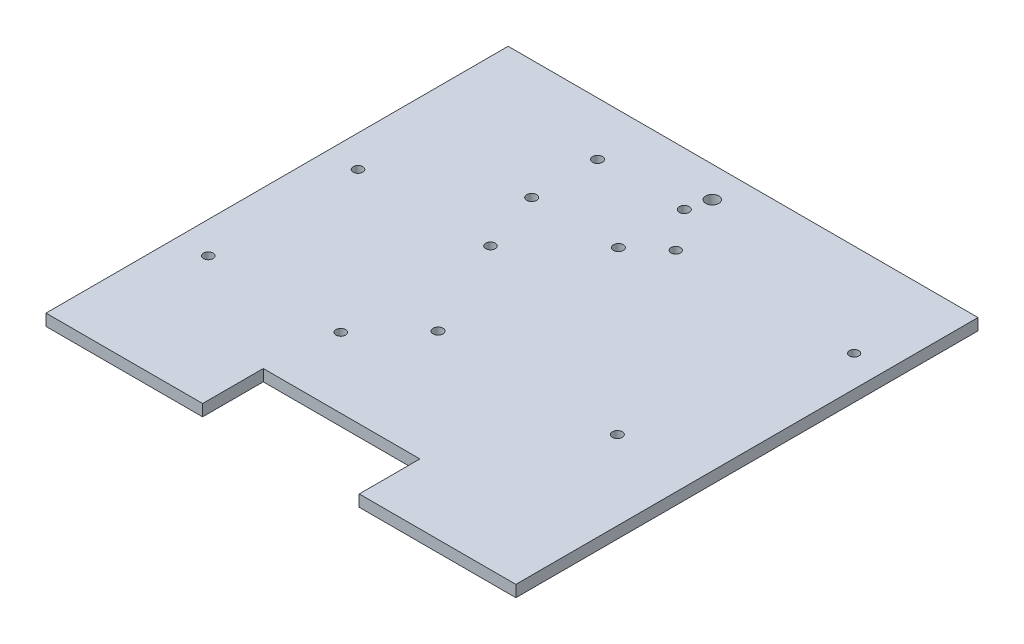
ISO-10303-21;
HEADER;
FILE_DESCRIPTION(('STEP AP214'),'2;1');
FILE_NAME('part.step','',(''),(''),'','','');
FILE_SCHEMA(('AUTOMOTIVE_DESIGN { 1 0 10303 214 1 1 1 1 }'));
ENDSEC;
DATA;
#1=APPLICATION_CONTEXT('core data for automotive mechanical design processes');
#2=APPLICATION_PROTOCOL_DEFINITION('international standard','automotive_design',2000,#1);
#3=PRODUCT_CONTEXT('',#1,'mechanical');
#4=PRODUCT('Part','Part','',(#3));
#5=PRODUCT_RELATED_PRODUCT_CATEGORY('part','',(#4));
#6=PRODUCT_DEFINITION_FORMATION('','',#4);
#7=PRODUCT_DEFINITION_CONTEXT('part definition',#1,'design');
#8=PRODUCT_DEFINITION('design','',#6,#7);
#9=PRODUCT_DEFINITION_SHAPE('','',#8);
#10=(LENGTH_UNIT() NAMED_UNIT(*) SI_UNIT(.MILLI.,.METRE.));
#11=(NAMED_UNIT(*) PLANE_ANGLE_UNIT() SI_UNIT($,.RADIAN.));
#12=(NAMED_UNIT(*) SI_UNIT($,.STERADIAN.) SOLID_ANGLE_UNIT());
#13=UNCERTAINTY_MEASURE_WITH_UNIT(LENGTH_MEASURE(1.E-05),#10,'distance_accuracy_value','');
#14=(GEOMETRIC_REPRESENTATION_CONTEXT(3) GLOBAL_UNCERTAINTY_ASSIGNED_CONTEXT((#13)) GLOBAL_UNIT_ASSIGNED_CONTEXT((#10,
#11,#12)) REPRESENTATION_CONTEXT('',''));
#15=CARTESIAN_POINT('',(0.,0.,0.));
#16=DIRECTION('',(0.,0.,1.));
#17=DIRECTION('',(1.,0.,0.));
#18=AXIS2_PLACEMENT_3D('',#15,#16,#17);
#19=CARTESIAN_POINT('',(0.,4.78,0.));
#20=DIRECTION('',(0.,-1.,0.));
#21=DIRECTION('',(0.,0.,-1.));
#22=AXIS2_PLACEMENT_3D('',#19,#20,#21);
#23=PLANE('',#22);
#24=CARTESIAN_POINT('',(-38.0049999999998,4.78,-73.2749999992753));
#25=DIRECTION('',(0.,1.,0.));
#26=DIRECTION('',(0.,0.,1.));
#27=AXIS2_PLACEMENT_3D('',#24,#25,#26);
#28=CIRCLE('',#27,2.048699992);
#29=CARTESIAN_POINT('',(-38.0049999999998,4.78,-71.2263000072753));
#30=VERTEX_POINT('',#29);
#31=EDGE_CURVE('E208',#30,#30,#28,.T.);
#32=ORIENTED_EDGE('',*,*,#31,.F.);
#33=EDGE_LOOP('',(#32));
#34=FACE_BOUND('',#33,.T.);
#35=CARTESIAN_POINT('',(-83.822499998781,4.78,-20.3400000010795));
#36=DIRECTION('',(0.,1.,0.));
#37=DIRECTION('',(0.,0.,1.));
#38=AXIS2_PLACEMENT_3D('',#35,#36,#37);
#39=CIRCLE('',#38,1.9812);
#40=CARTESIAN_POINT('',(-83.822499998781,4.78,-18.3588000010795));
#41=VERTEX_POINT('',#40);
#42=EDGE_CURVE('E231',#41,#41,#39,.T.);
#43=ORIENTED_EDGE('',*,*,#42,.F.);
#44=EDGE_LOOP('',(#43));
#45=FACE_BOUND('',#44,.T.);
#46=CARTESIAN_POINT('',(-9.61000000000007,4.78,20.864999962));
#47=DIRECTION('',(0.,1.,0.));
#48=DIRECTION('',(0.,0.,1.));
#49=AXIS2_PLACEMENT_3D('',#46,#47,#48);
#50=CIRCLE('',#49,2.038700012);
#51=CARTESIAN_POINT('',(-9.61000000000007,4.78,22.903699974));
#52=VERTEX_POINT('',#51);
#53=EDGE_CURVE('E189',#52,#52,#50,.T.);
#54=ORIENTED_EDGE('',*,*,#53,.F.);
#55=EDGE_LOOP('',(#54));
#56=FACE_BOUND('',#55,.T.);
#57=CARTESIAN_POINT('',(84.0775,4.78,-56.9625000000001));
#58=DIRECTION('',(0.,1.,0.));
#59=DIRECTION('',(0.,0.,1.));
#60=AXIS2_PLACEMENT_3D('',#57,#58,#59);
#61=CIRCLE('',#60,1.93619996299999);
#62=CARTESIAN_POINT('',(84.0775,4.78,-55.0263000370001));
#63=VERTEX_POINT('',#62);
#64=EDGE_CURVE('E195',#63,#63,#61,.T.);
#65=ORIENTED_EDGE('',*,*,#64,.F.);
#66=EDGE_LOOP('',(#65));
#67=FACE_BOUND('',#66,.T.);
#68=CARTESIAN_POINT('',(10.5225,4.78,-56.9625000620011));
#69=DIRECTION('',(0.,1.,0.));
#70=DIRECTION('',(0.,0.,1.));
#71=AXIS2_PLACEMENT_3D('',#68,#69,#70);
#72=CIRCLE('',#71,1.936199963);
#73=CARTESIAN_POINT('',(10.5225,4.78,-55.0263000990011));
#74=VERTEX_POINT('',#73);
#75=EDGE_CURVE('E196',#74,#74,#72,.T.);
#76=ORIENTED_EDGE('',*,*,#75,.F.);
#77=EDGE_LOOP('',(#76));
#78=FACE_BOUND('',#77,.T.);
#79=CARTESIAN_POINT('',(-2.25499999999983,4.78,-73.275));
#80=DIRECTION('',(0.,1.,0.));
#81=DIRECTION('',(0.,0.,1.));
#82=AXIS2_PLACEMENT_3D('',#79,#80,#81);
#83=CIRCLE('',#82,2.048699992);
#84=CARTESIAN_POINT('',(-2.25499999999983,4.78,-71.226300008));
#85=VERTEX_POINT('',#84);
#86=EDGE_CURVE('E207',#85,#85,#83,.T.);
#87=ORIENTED_EDGE('',*,*,#86,.F.);
#88=EDGE_LOOP('',(#87));
#89=FACE_BOUND('',#88,.T.);
#90=CARTESIAN_POINT('',(-29.2124999987812,4.78,-20.3400000000002));
#91=DIRECTION('',(0.,1.,0.));
#92=DIRECTION('',(0.,0.,1.));
#93=AXIS2_PLACEMENT_3D('',#90,#91,#92);
#94=CIRCLE('',#93,1.9812);
#95=CARTESIAN_POINT('',(-29.2124999987812,4.78,-18.3588000000002));
#96=VERTEX_POINT('',#95);
#97=EDGE_CURVE('E232',#96,#96,#94,.T.);
#98=ORIENTED_EDGE('',*,*,#97,.F.);
#99=EDGE_LOOP('',(#98));
#100=FACE_BOUND('',#99,.T.);
#101=CARTESIAN_POINT('',(-29.2125000000009,4.78,41.3819999999998));
#102=DIRECTION('',(0.,1.,0.));
#103=DIRECTION('',(0.,0.,1.));
#104=AXIS2_PLACEMENT_3D('',#101,#102,#103);
#105=CIRCLE('',#104,1.9812);
#106=CARTESIAN_POINT('',(-29.2125000000009,4.78,43.3631999999998));
#107=VERTEX_POINT('',#106);
#108=EDGE_CURVE('E249',#107,#107,#105,.T.);
#109=ORIENTED_EDGE('',*,*,#108,.F.);
#110=EDGE_LOOP('',(#109));
#111=FACE_BOUND('',#110,.T.);
#112=CARTESIAN_POINT('',(-83.8225000000009,4.78,41.3819999989208));
#113=DIRECTION('',(0.,1.,0.));
#114=DIRECTION('',(0.,0.,1.));
#115=AXIS2_PLACEMENT_3D('',#112,#113,#114);
#116=CIRCLE('',#115,1.9812);
#117=CARTESIAN_POINT('',(-83.8225000000009,4.78,43.3631999989208));
#118=VERTEX_POINT('',#117);
#119=EDGE_CURVE('E243',#118,#118,#116,.T.);
#120=ORIENTED_EDGE('',*,*,#119,.F.);
#121=EDGE_LOOP('',(#120));
#122=FACE_BOUND('',#121,.T.);
#123=CARTESIAN_POINT('',(64.2699999999999,4.78,20.864999962));
#124=DIRECTION('',(0.,1.,0.));
#125=DIRECTION('',(0.,0.,1.));
#126=AXIS2_PLACEMENT_3D('',#123,#124,#125);
#127=CIRCLE('',#126,2.038700012);
#128=CARTESIAN_POINT('',(64.2699999999999,4.78,22.903699974));
#129=VERTEX_POINT('',#128);
#130=EDGE_CURVE('E186',#129,#129,#127,.T.);
#131=ORIENTED_EDGE('',*,*,#130,.F.);
#132=EDGE_LOOP('',(#131));
#133=FACE_BOUND('',#132,.T.);
#134=CARTESIAN_POINT('',(0.,4.78,-82.55));
#135=DIRECTION('',(0.,1.,0.));
#136=DIRECTION('',(0.,0.,1.));
#137=AXIS2_PLACEMENT_3D('',#134,#135,#136);
#138=CIRCLE('',#137,2.6797);
#139=CARTESIAN_POINT('',(0.,4.78,-79.8703));
#140=VERTEX_POINT('',#139);
#141=EDGE_CURVE('E168',#140,#140,#138,.T.);
#142=ORIENTED_EDGE('',*,*,#141,.F.);
#143=EDGE_LOOP('',(#142));
#144=FACE_BOUND('',#143,.T.);
#145=DIRECTION('',(1.,0.,0.));
#146=VECTOR('',#145,1.);
#147=CARTESIAN_POINT('',(-96.84,4.78,95.25));
#148=LINE('',#147,#146);
#149=CARTESIAN_POINT('',(-96.84,4.78,95.25));
#150=VERTEX_POINT('',#149);
#151=CARTESIAN_POINT('',(-32.28,4.78,95.25));
#152=VERTEX_POINT('',#151);
#153=EDGE_CURVE('E139',#150,#152,#148,.T.);
#154=ORIENTED_EDGE('',*,*,#153,.T.);
#155=DIRECTION('',(0.,0.,1.));
#156=VECTOR('',#155,1.);
#157=CARTESIAN_POINT('',(-32.28,4.78,95.25));
#158=LINE('',#157,#156);
#159=CARTESIAN_POINT('',(-32.28,4.78,70.249999962));
#160=VERTEX_POINT('',#159);
#161=EDGE_CURVE('E116',#160,#152,#158,.T.);
#162=ORIENTED_EDGE('',*,*,#161,.F.);
#163=DIRECTION('',(-1.,0.,0.));
#164=VECTOR('',#163,1.);
#165=CARTESIAN_POINT('',(-32.28,4.78,70.249999962));
#166=LINE('',#165,#164);
#167=CARTESIAN_POINT('',(32.28,4.78,70.249999962));
#168=VERTEX_POINT('',#167);
#169=EDGE_CURVE('E178',#168,#160,#166,.T.);
#170=ORIENTED_EDGE('',*,*,#169,.F.);
#171=DIRECTION('',(0.,0.,-1.));
#172=VECTOR('',#171,1.);
#173=CARTESIAN_POINT('',(32.28,4.78,70.249999962));
#174=LINE('',#173,#172);
#175=CARTESIAN_POINT('',(32.28,4.78,95.25));
#176=VERTEX_POINT('',#175);
#177=EDGE_CURVE('E181',#176,#168,#174,.T.);
#178=ORIENTED_EDGE('',*,*,#177,.F.);
#179=CARTESIAN_POINT('',(96.84,4.78,95.25));
#180=VERTEX_POINT('',#179);
#181=EDGE_CURVE('E60',#176,#180,#148,.T.);
#182=ORIENTED_EDGE('',*,*,#181,.T.);
#183=DIRECTION('',(0.,0.,-1.));
#184=VECTOR('',#183,1.);
#185=CARTESIAN_POINT('',(96.84,4.78,95.25));
#186=LINE('',#185,#184);
#187=CARTESIAN_POINT('',(96.84,4.78,-95.25));
#188=VERTEX_POINT('',#187);
#189=EDGE_CURVE('E131',#180,#188,#186,.T.);
#190=ORIENTED_EDGE('',*,*,#189,.T.);
#191=DIRECTION('',(-1.,0.,0.));
#192=VECTOR('',#191,1.);
#193=CARTESIAN_POINT('',(-96.84,4.78,-95.25));
#194=LINE('',#193,#192);
#195=CARTESIAN_POINT('',(-96.84,4.78,-95.25));
#196=VERTEX_POINT('',#195);
#197=EDGE_CURVE('E89',#188,#196,#194,.T.);
#198=ORIENTED_EDGE('',*,*,#197,.T.);
#199=DIRECTION('',(0.,0.,1.));
#200=VECTOR('',#199,1.);
#201=CARTESIAN_POINT('',(-96.84,4.78,95.25));
#202=LINE('',#201,#200);
#203=EDGE_CURVE('E147',#196,#150,#202,.T.);
#204=ORIENTED_EDGE('',*,*,#203,.T.);
#205=EDGE_LOOP('',(#154,#162,#170,#178,#182,#190,#198,#204));
#206=FACE_BOUND('',#205,.T.);
#207=CARTESIAN_POINT('',(-2.25500000000001,4.78,-46.125));
#208=DIRECTION('',(0.,-1.,0.));
#209=DIRECTION('',(0.,0.,-1.));
#210=AXIS2_PLACEMENT_3D('',#207,#208,#209);
#211=CIRCLE('',#210,2.048699992);
#212=CARTESIAN_POINT('',(-2.25500000000001,4.78,-48.173699992));
#213=VERTEX_POINT('',#212);
#214=EDGE_CURVE('E220',#213,#213,#211,.T.);
#215=ORIENTED_EDGE('',*,*,#214,.T.);
#216=EDGE_LOOP('',(#215));
#217=FACE_BOUND('',#216,.T.);
#218=CARTESIAN_POINT('',(-38.0050000000001,4.78,-46.1250000007241));
#219=DIRECTION('',(0.,-1.,0.));
#220=DIRECTION('',(0.,0.,-1.));
#221=AXIS2_PLACEMENT_3D('',#218,#219,#220);
#222=CIRCLE('',#221,2.048699992);
#223=CARTESIAN_POINT('',(-38.0050000000001,4.78,-48.1736999927241));
#224=VERTEX_POINT('',#223);
#225=EDGE_CURVE('E219',#224,#224,#222,.T.);
#226=ORIENTED_EDGE('',*,*,#225,.T.);
#227=EDGE_LOOP('',(#226));
#228=FACE_BOUND('',#227,.T.);
#229=ADVANCED_FACE('F36',(#34,#45,#56,#67,#78,#89,#100,#111,#122,#133,#144,#206,#217,#228),#23,.F.);
#230=CARTESIAN_POINT('',(0.,0.,0.));
#231=DIRECTION('',(0.,-1.,0.));
#232=DIRECTION('',(0.,0.,-1.));
#233=AXIS2_PLACEMENT_3D('',#230,#231,#232);
#234=PLANE('',#233);
#235=CARTESIAN_POINT('',(-38.0049999999998,0.,-73.2749999992753));
#236=DIRECTION('',(0.,1.,0.));
#237=DIRECTION('',(0.,0.,1.));
#238=AXIS2_PLACEMENT_3D('',#235,#236,#237);
#239=CIRCLE('',#238,2.048699992);
#240=CARTESIAN_POINT('',(-38.0049999999998,0.,-71.2263000072753));
#241=VERTEX_POINT('',#240);
#242=EDGE_CURVE('E223',#241,#241,#239,.T.);
#243=ORIENTED_EDGE('',*,*,#242,.T.);
#244=EDGE_LOOP('',(#243));
#245=FACE_BOUND('',#244,.T.);
#246=CARTESIAN_POINT('',(-2.25500000000001,0.,-46.125));
#247=DIRECTION('',(0.,-1.,0.));
#248=DIRECTION('',(0.,0.,-1.));
#249=AXIS2_PLACEMENT_3D('',#246,#247,#248);
#250=CIRCLE('',#249,2.048699992);
#251=CARTESIAN_POINT('',(-2.25500000000001,0.,-48.173699992));
#252=VERTEX_POINT('',#251);
#253=EDGE_CURVE('E235',#252,#252,#250,.T.);
#254=ORIENTED_EDGE('',*,*,#253,.F.);
#255=EDGE_LOOP('',(#254));
#256=FACE_BOUND('',#255,.T.);
#257=CARTESIAN_POINT('',(-83.822499998781,0.,-20.3400000010795));
#258=DIRECTION('',(0.,1.,0.));
#259=DIRECTION('',(0.,0.,1.));
#260=AXIS2_PLACEMENT_3D('',#257,#258,#259);
#261=CIRCLE('',#260,1.9812);
#262=CARTESIAN_POINT('',(-83.822499998781,0.,-18.3588000010795));
#263=VERTEX_POINT('',#262);
#264=EDGE_CURVE('E228',#263,#263,#261,.T.);
#265=ORIENTED_EDGE('',*,*,#264,.T.);
#266=EDGE_LOOP('',(#265));
#267=FACE_BOUND('',#266,.T.);
#268=CARTESIAN_POINT('',(-9.61000000000007,0.,20.864999962));
#269=DIRECTION('',(0.,1.,0.));
#270=DIRECTION('',(0.,0.,1.));
#271=AXIS2_PLACEMENT_3D('',#268,#269,#270);
#272=CIRCLE('',#271,2.038700012);
#273=CARTESIAN_POINT('',(-9.61000000000007,0.,22.903699974));
#274=VERTEX_POINT('',#273);
#275=EDGE_CURVE('E199',#274,#274,#272,.T.);
#276=ORIENTED_EDGE('',*,*,#275,.T.);
#277=EDGE_LOOP('',(#276));
#278=FACE_BOUND('',#277,.T.);
#279=CARTESIAN_POINT('',(84.0775,0.,-56.9625000000001));
#280=DIRECTION('',(0.,1.,0.));
#281=DIRECTION('',(0.,0.,1.));
#282=AXIS2_PLACEMENT_3D('',#279,#280,#281);
#283=CIRCLE('',#282,1.93619996299999);
#284=CARTESIAN_POINT('',(84.0775,0.,-55.0263000370001));
#285=VERTEX_POINT('',#284);
#286=EDGE_CURVE('E192',#285,#285,#283,.T.);
#287=ORIENTED_EDGE('',*,*,#286,.T.);
#288=EDGE_LOOP('',(#287));
#289=FACE_BOUND('',#288,.T.);
#290=CARTESIAN_POINT('',(10.5225,0.,-56.9625000620011));
#291=DIRECTION('',(0.,1.,0.));
#292=DIRECTION('',(0.,0.,1.));
#293=AXIS2_PLACEMENT_3D('',#290,#291,#292);
#294=CIRCLE('',#293,1.936199963);
#295=CARTESIAN_POINT('',(10.5225,0.,-55.0263000990011));
#296=VERTEX_POINT('',#295);
#297=EDGE_CURVE('E211',#296,#296,#294,.T.);
#298=ORIENTED_EDGE('',*,*,#297,.T.);
#299=EDGE_LOOP('',(#298));
#300=FACE_BOUND('',#299,.T.);
#301=CARTESIAN_POINT('',(-2.25499999999983,0.,-73.275));
#302=DIRECTION('',(0.,1.,0.));
#303=DIRECTION('',(0.,0.,1.));
#304=AXIS2_PLACEMENT_3D('',#301,#302,#303);
#305=CIRCLE('',#304,2.048699992);
#306=CARTESIAN_POINT('',(-2.25499999999983,0.,-71.226300008));
#307=VERTEX_POINT('',#306);
#308=EDGE_CURVE('E204',#307,#307,#305,.T.);
#309=ORIENTED_EDGE('',*,*,#308,.T.);
#310=EDGE_LOOP('',(#309));
#311=FACE_BOUND('',#310,.T.);
#312=CARTESIAN_POINT('',(-29.2124999987812,0.,-20.3400000000002));
#313=DIRECTION('',(0.,1.,0.));
#314=DIRECTION('',(0.,0.,1.));
#315=AXIS2_PLACEMENT_3D('',#312,#313,#314);
#316=CIRCLE('',#315,1.9812);
#317=CARTESIAN_POINT('',(-29.2124999987812,0.,-18.3588000000002));
#318=VERTEX_POINT('',#317);
#319=EDGE_CURVE('E252',#318,#318,#316,.T.);
#320=ORIENTED_EDGE('',*,*,#319,.T.);
#321=EDGE_LOOP('',(#320));
#322=FACE_BOUND('',#321,.T.);
#323=CARTESIAN_POINT('',(-29.2125000000009,0.,41.3819999999998));
#324=DIRECTION('',(0.,1.,0.));
#325=DIRECTION('',(0.,0.,1.));
#326=AXIS2_PLACEMENT_3D('',#323,#324,#325);
#327=CIRCLE('',#326,1.9812);
#328=CARTESIAN_POINT('',(-29.2125000000009,0.,43.3631999999998));
#329=VERTEX_POINT('',#328);
#330=EDGE_CURVE('E246',#329,#329,#327,.T.);
#331=ORIENTED_EDGE('',*,*,#330,.T.);
#332=EDGE_LOOP('',(#331));
#333=FACE_BOUND('',#332,.T.);
#334=CARTESIAN_POINT('',(-83.8225000000009,0.,41.3819999989208));
#335=DIRECTION('',(0.,1.,0.));
#336=DIRECTION('',(0.,0.,1.));
#337=AXIS2_PLACEMENT_3D('',#334,#335,#336);
#338=CIRCLE('',#337,1.9812);
#339=CARTESIAN_POINT('',(-83.8225000000009,0.,43.3631999989208));
#340=VERTEX_POINT('',#339);
#341=EDGE_CURVE('E240',#340,#340,#338,.T.);
#342=ORIENTED_EDGE('',*,*,#341,.T.);
#343=EDGE_LOOP('',(#342));
#344=FACE_BOUND('',#343,.T.);
#345=CARTESIAN_POINT('',(64.2699999999999,0.,20.864999962));
#346=DIRECTION('',(0.,1.,0.));
#347=DIRECTION('',(0.,0.,1.));
#348=AXIS2_PLACEMENT_3D('',#345,#346,#347);
#349=CIRCLE('',#348,2.038700012);
#350=CARTESIAN_POINT('',(64.2699999999999,0.,22.903699974));
#351=VERTEX_POINT('',#350);
#352=EDGE_CURVE('E183',#351,#351,#349,.T.);
#353=ORIENTED_EDGE('',*,*,#352,.T.);
#354=EDGE_LOOP('',(#353));
#355=FACE_BOUND('',#354,.T.);
#356=DIRECTION('',(0.,0.,1.));
#357=VECTOR('',#356,1.);
#358=CARTESIAN_POINT('',(-32.28,0.,95.25));
#359=LINE('',#358,#357);
#360=CARTESIAN_POINT('',(-32.28,0.,70.249999962));
#361=VERTEX_POINT('',#360);
#362=CARTESIAN_POINT('',(-32.28,0.,95.25));
#363=VERTEX_POINT('',#362);
#364=EDGE_CURVE('E119',#361,#363,#359,.T.);
#365=ORIENTED_EDGE('',*,*,#364,.T.);
#366=DIRECTION('',(1.,0.,0.));
#367=VECTOR('',#366,1.);
#368=CARTESIAN_POINT('',(-96.84,0.,95.25));
#369=LINE('',#368,#367);
#370=CARTESIAN_POINT('',(-96.84,0.,95.25));
#371=VERTEX_POINT('',#370);
#372=EDGE_CURVE('E127',#371,#363,#369,.T.);
#373=ORIENTED_EDGE('',*,*,#372,.F.);
#374=DIRECTION('',(0.,0.,1.));
#375=VECTOR('',#374,1.);
#376=CARTESIAN_POINT('',(-96.84,0.,95.25));
#377=LINE('',#376,#375);
#378=CARTESIAN_POINT('',(-96.84,0.,-95.25));
#379=VERTEX_POINT('',#378);
#380=EDGE_CURVE('E128',#379,#371,#377,.T.);
#381=ORIENTED_EDGE('',*,*,#380,.F.);
#382=DIRECTION('',(-1.,0.,0.));
#383=VECTOR('',#382,1.);
#384=CARTESIAN_POINT('',(-96.84,0.,-95.25));
#385=LINE('',#384,#383);
#386=CARTESIAN_POINT('',(96.84,0.,-95.25));
#387=VERTEX_POINT('',#386);
#388=EDGE_CURVE('E132',#387,#379,#385,.T.);
#389=ORIENTED_EDGE('',*,*,#388,.F.);
#390=DIRECTION('',(0.,0.,-1.));
#391=VECTOR('',#390,1.);
#392=CARTESIAN_POINT('',(96.84,0.,95.25));
#393=LINE('',#392,#391);
#394=CARTESIAN_POINT('',(96.84,0.,95.25));
#395=VERTEX_POINT('',#394);
#396=EDGE_CURVE('E126',#395,#387,#393,.T.);
#397=ORIENTED_EDGE('',*,*,#396,.F.);
#398=CARTESIAN_POINT('',(32.28,0.,95.25));
#399=VERTEX_POINT('',#398);
#400=EDGE_CURVE('E82',#399,#395,#369,.T.);
#401=ORIENTED_EDGE('',*,*,#400,.F.);
#402=DIRECTION('',(0.,0.,-1.));
#403=VECTOR('',#402,1.);
#404=CARTESIAN_POINT('',(32.28,0.,70.249999962));
#405=LINE('',#404,#403);
#406=CARTESIAN_POINT('',(32.28,0.,70.249999962));
#407=VERTEX_POINT('',#406);
#408=EDGE_CURVE('E110',#399,#407,#405,.T.);
#409=ORIENTED_EDGE('',*,*,#408,.T.);
#410=DIRECTION('',(-1.,0.,0.));
#411=VECTOR('',#410,1.);
#412=CARTESIAN_POINT('',(-32.28,0.,70.249999962));
#413=LINE('',#412,#411);
#414=EDGE_CURVE('E51',#407,#361,#413,.T.);
#415=ORIENTED_EDGE('',*,*,#414,.T.);
#416=EDGE_LOOP('',(#365,#373,#381,#389,#397,#401,#409,#415));
#417=FACE_BOUND('',#416,.T.);
#418=CARTESIAN_POINT('',(0.,0.,-82.55));
#419=DIRECTION('',(0.,1.,0.));
#420=DIRECTION('',(0.,0.,1.));
#421=AXIS2_PLACEMENT_3D('',#418,#419,#420);
#422=CIRCLE('',#421,2.6797);
#423=CARTESIAN_POINT('',(0.,0.,-79.8703));
#424=VERTEX_POINT('',#423);
#425=EDGE_CURVE('E161',#424,#424,#422,.T.);
#426=ORIENTED_EDGE('',*,*,#425,.T.);
#427=EDGE_LOOP('',(#426));
#428=FACE_BOUND('',#427,.T.);
#429=CARTESIAN_POINT('',(-38.0050000000001,0.,-46.1250000007241));
#430=DIRECTION('',(0.,-1.,0.));
#431=DIRECTION('',(0.,0.,-1.));
#432=AXIS2_PLACEMENT_3D('',#429,#430,#431);
#433=CIRCLE('',#432,2.048699992);
#434=CARTESIAN_POINT('',(-38.0050000000001,0.,-48.1736999927241));
#435=VERTEX_POINT('',#434);
#436=EDGE_CURVE('E216',#435,#435,#433,.T.);
#437=ORIENTED_EDGE('',*,*,#436,.F.);
#438=EDGE_LOOP('',(#437));
#439=FACE_BOUND('',#438,.T.);
#440=ADVANCED_FACE('F123',(#245,#256,#267,#278,#289,#300,#311,#322,#333,#344,#355,#417,#428,
#439),#234,.T.);
#441=CARTESIAN_POINT('',(-96.84,4.78,95.25));
#442=DIRECTION('',(0.,0.,-1.));
#443=DIRECTION('',(-1.,0.,0.));
#444=AXIS2_PLACEMENT_3D('',#441,#442,#443);
#445=PLANE('',#444);
#446=ORIENTED_EDGE('',*,*,#372,.T.);
#447=DIRECTION('',(0.,1.,0.));
#448=VECTOR('',#447,1.);
#449=CARTESIAN_POINT('',(-32.28,0.,95.25));
#450=LINE('',#449,#448);
#451=EDGE_CURVE('E154',#363,#152,#450,.T.);
#452=ORIENTED_EDGE('',*,*,#451,.T.);
#453=ORIENTED_EDGE('',*,*,#153,.F.);
#454=DIRECTION('',(0.,-1.,0.));
#455=VECTOR('',#454,1.);
#456=CARTESIAN_POINT('',(-96.84,4.78,95.25));
#457=LINE('',#456,#455);
#458=EDGE_CURVE('E138',#150,#371,#457,.T.);
#459=ORIENTED_EDGE('',*,*,#458,.T.);
#460=EDGE_LOOP('',(#446,#452,#453,#459));
#461=FACE_BOUND('',#460,.T.);
#462=ADVANCED_FACE('F152',(#461),#445,.F.);
#463=CARTESIAN_POINT('',(96.84,4.78,95.25));
#464=DIRECTION('',(-1.,0.,0.));
#465=DIRECTION('',(0.,0.,1.));
#466=AXIS2_PLACEMENT_3D('',#463,#464,#465);
#467=PLANE('',#466);
#468=ORIENTED_EDGE('',*,*,#396,.T.);
#469=DIRECTION('',(0.,-1.,0.));
#470=VECTOR('',#469,1.);
#471=CARTESIAN_POINT('',(96.84,4.78,-95.25));
#472=LINE('',#471,#470);
#473=EDGE_CURVE('E11',#188,#387,#472,.T.);
#474=ORIENTED_EDGE('',*,*,#473,.F.);
#475=ORIENTED_EDGE('',*,*,#189,.F.);
#476=DIRECTION('',(0.,-1.,0.));
#477=VECTOR('',#476,1.);
#478=CARTESIAN_POINT('',(96.84,4.78,95.25));
#479=LINE('',#478,#477);
#480=EDGE_CURVE('E136',#180,#395,#479,.T.);
#481=ORIENTED_EDGE('',*,*,#480,.T.);
#482=EDGE_LOOP('',(#468,#474,#475,#481));
#483=FACE_BOUND('',#482,.T.);
#484=ADVANCED_FACE('F38',(#483),#467,.F.);
#485=CARTESIAN_POINT('',(-96.84,4.78,-95.25));
#486=DIRECTION('',(0.,0.,1.));
#487=DIRECTION('',(1.,0.,0.));
#488=AXIS2_PLACEMENT_3D('',#485,#486,#487);
#489=PLANE('',#488);
#490=ORIENTED_EDGE('',*,*,#388,.T.);
#491=DIRECTION('',(0.,-1.,0.));
#492=VECTOR('',#491,1.);
#493=CARTESIAN_POINT('',(-96.84,4.78,-95.25));
#494=LINE('',#493,#492);
#495=EDGE_CURVE('E44',#196,#379,#494,.T.);
#496=ORIENTED_EDGE('',*,*,#495,.F.);
#497=ORIENTED_EDGE('',*,*,#197,.F.);
#498=ORIENTED_EDGE('',*,*,#473,.T.);
#499=EDGE_LOOP('',(#490,#496,#497,#498));
#500=FACE_BOUND('',#499,.T.);
#501=ADVANCED_FACE('F162',(#500),#489,.F.);
#502=CARTESIAN_POINT('',(-96.84,4.78,95.25));
#503=DIRECTION('',(1.,0.,0.));
#504=DIRECTION('',(0.,0.,-1.));
#505=AXIS2_PLACEMENT_3D('',#502,#503,#504);
#506=PLANE('',#505);
#507=ORIENTED_EDGE('',*,*,#380,.T.);
#508=ORIENTED_EDGE('',*,*,#458,.F.);
#509=ORIENTED_EDGE('',*,*,#203,.F.);
#510=ORIENTED_EDGE('',*,*,#495,.T.);
#511=EDGE_LOOP('',(#507,#508,#509,#510));
#512=FACE_BOUND('',#511,.T.);
#513=ADVANCED_FACE('F145',(#512),#506,.F.);
#514=ORIENTED_EDGE('',*,*,#181,.F.);
#515=DIRECTION('',(0.,1.,0.));
#516=VECTOR('',#515,1.);
#517=CARTESIAN_POINT('',(32.28,0.,95.25));
#518=LINE('',#517,#516);
#519=EDGE_CURVE('E113',#399,#176,#518,.T.);
#520=ORIENTED_EDGE('',*,*,#519,.F.);
#521=ORIENTED_EDGE('',*,*,#400,.T.);
#522=ORIENTED_EDGE('',*,*,#480,.F.);
#523=EDGE_LOOP('',(#514,#520,#521,#522));
#524=FACE_BOUND('',#523,.T.);
#525=ADVANCED_FACE('F118',(#524),#445,.F.);
#526=CARTESIAN_POINT('',(0.,0.,-82.55));
#527=DIRECTION('',(0.,1.,0.));
#528=DIRECTION('',(0.,0.,1.));
#529=AXIS2_PLACEMENT_3D('',#526,#527,#528);
#530=CYLINDRICAL_SURFACE('',#529,2.6797);
#531=ORIENTED_EDGE('',*,*,#425,.F.);
#532=EDGE_LOOP('',(#531));
#533=FACE_BOUND('',#532,.T.);
#534=ORIENTED_EDGE('',*,*,#141,.T.);
#535=EDGE_LOOP('',(#534));
#536=FACE_BOUND('',#535,.T.);
#537=ADVANCED_FACE('F318',(#533,#536),#530,.F.);
#538=CARTESIAN_POINT('',(-32.28,0.,95.25));
#539=DIRECTION('',(-1.,0.,0.));
#540=DIRECTION('',(0.,0.,1.));
#541=AXIS2_PLACEMENT_3D('',#538,#539,#540);
#542=PLANE('',#541);
#543=ORIENTED_EDGE('',*,*,#161,.T.);
#544=ORIENTED_EDGE('',*,*,#451,.F.);
#545=ORIENTED_EDGE('',*,*,#364,.F.);
#546=DIRECTION('',(0.,1.,0.));
#547=VECTOR('',#546,1.);
#548=CARTESIAN_POINT('',(-32.28,0.,70.249999962));
#549=LINE('',#548,#547);
#550=EDGE_CURVE('E174',#361,#160,#549,.T.);
#551=ORIENTED_EDGE('',*,*,#550,.T.);
#552=EDGE_LOOP('',(#543,#544,#545,#551));
#553=FACE_BOUND('',#552,.T.);
#554=ADVANCED_FACE('F314',(#553),#542,.F.);
#555=CARTESIAN_POINT('',(-32.28,0.,70.249999962));
#556=DIRECTION('',(0.,0.,-1.));
#557=DIRECTION('',(-1.,0.,0.));
#558=AXIS2_PLACEMENT_3D('',#555,#556,#557);
#559=PLANE('',#558);
#560=ORIENTED_EDGE('',*,*,#169,.T.);
#561=ORIENTED_EDGE('',*,*,#550,.F.);
#562=ORIENTED_EDGE('',*,*,#414,.F.);
#563=DIRECTION('',(0.,1.,0.));
#564=VECTOR('',#563,1.);
#565=CARTESIAN_POINT('',(32.28,0.,70.249999962));
#566=LINE('',#565,#564);
#567=EDGE_CURVE('E114',#407,#168,#566,.T.);
#568=ORIENTED_EDGE('',*,*,#567,.T.);
#569=EDGE_LOOP('',(#560,#561,#562,#568));
#570=FACE_BOUND('',#569,.T.);
#571=ADVANCED_FACE('F317',(#570),#559,.F.);
#572=CARTESIAN_POINT('',(32.28,0.,70.249999962));
#573=DIRECTION('',(1.,0.,0.));
#574=DIRECTION('',(0.,0.,-1.));
#575=AXIS2_PLACEMENT_3D('',#572,#573,#574);
#576=PLANE('',#575);
#577=ORIENTED_EDGE('',*,*,#177,.T.);
#578=ORIENTED_EDGE('',*,*,#567,.F.);
#579=ORIENTED_EDGE('',*,*,#408,.F.);
#580=ORIENTED_EDGE('',*,*,#519,.T.);
#581=EDGE_LOOP('',(#577,#578,#579,#580));
#582=FACE_BOUND('',#581,.T.);
#583=ADVANCED_FACE('F112',(#582),#576,.F.);
#584=CARTESIAN_POINT('',(64.2699999999999,0.,20.864999962));
#585=DIRECTION('',(0.,1.,0.));
#586=DIRECTION('',(0.,0.,1.));
#587=AXIS2_PLACEMENT_3D('',#584,#585,#586);
#588=CYLINDRICAL_SURFACE('',#587,2.038700012);
#589=ORIENTED_EDGE('',*,*,#352,.F.);
#590=EDGE_LOOP('',(#589));
#591=FACE_BOUND('',#590,.T.);
#592=ORIENTED_EDGE('',*,*,#130,.T.);
#593=EDGE_LOOP('',(#592));
#594=FACE_BOUND('',#593,.T.);
#595=ADVANCED_FACE('F309',(#591,#594),#588,.F.);
#596=CARTESIAN_POINT('',(-83.8225000000009,0.,41.3819999989208));
#597=DIRECTION('',(0.,1.,0.));
#598=DIRECTION('',(0.,0.,1.));
#599=AXIS2_PLACEMENT_3D('',#596,#597,#598);
#600=CYLINDRICAL_SURFACE('',#599,1.9812);
#601=ORIENTED_EDGE('',*,*,#341,.F.);
#602=EDGE_LOOP('',(#601));
#603=FACE_BOUND('',#602,.T.);
#604=ORIENTED_EDGE('',*,*,#119,.T.);
#605=EDGE_LOOP('',(#604));
#606=FACE_BOUND('',#605,.T.);
#607=ADVANCED_FACE('F312',(#603,#606),#600,.F.);
#608=CARTESIAN_POINT('',(-29.2125000000009,0.,41.3819999999998));
#609=DIRECTION('',(0.,1.,0.));
#610=DIRECTION('',(0.,0.,1.));
#611=AXIS2_PLACEMENT_3D('',#608,#609,#610);
#612=CYLINDRICAL_SURFACE('',#611,1.9812);
#613=ORIENTED_EDGE('',*,*,#330,.F.);
#614=EDGE_LOOP('',(#613));
#615=FACE_BOUND('',#614,.T.);
#616=ORIENTED_EDGE('',*,*,#108,.T.);
#617=EDGE_LOOP('',(#616));
#618=FACE_BOUND('',#617,.T.);
#619=ADVANCED_FACE('F408',(#615,#618),#612,.F.);
#620=CARTESIAN_POINT('',(-29.2124999987812,0.,-20.3400000000002));
#621=DIRECTION('',(0.,1.,0.));
#622=DIRECTION('',(0.,0.,1.));
#623=AXIS2_PLACEMENT_3D('',#620,#621,#622);
#624=CYLINDRICAL_SURFACE('',#623,1.9812);
#625=ORIENTED_EDGE('',*,*,#319,.F.);
#626=EDGE_LOOP('',(#625));
#627=FACE_BOUND('',#626,.T.);
#628=ORIENTED_EDGE('',*,*,#97,.T.);
#629=EDGE_LOOP('',(#628));
#630=FACE_BOUND('',#629,.T.);
#631=ADVANCED_FACE('F258',(#627,#630),#624,.F.);
#632=CARTESIAN_POINT('',(-2.25499999999983,0.,-73.275));
#633=DIRECTION('',(0.,1.,0.));
#634=DIRECTION('',(0.,0.,1.));
#635=AXIS2_PLACEMENT_3D('',#632,#633,#634);
#636=CYLINDRICAL_SURFACE('',#635,2.048699992);
#637=ORIENTED_EDGE('',*,*,#308,.F.);
#638=EDGE_LOOP('',(#637));
#639=FACE_BOUND('',#638,.T.);
#640=ORIENTED_EDGE('',*,*,#86,.T.);
#641=EDGE_LOOP('',(#640));
#642=FACE_BOUND('',#641,.T.);
#643=ADVANCED_FACE('F297',(#639,#642),#636,.F.);
#644=CARTESIAN_POINT('',(10.5225,0.,-56.9625000620011));
#645=DIRECTION('',(0.,1.,0.));
#646=DIRECTION('',(0.,0.,1.));
#647=AXIS2_PLACEMENT_3D('',#644,#645,#646);
#648=CYLINDRICAL_SURFACE('',#647,1.936199963);
#649=ORIENTED_EDGE('',*,*,#297,.F.);
#650=EDGE_LOOP('',(#649));
#651=FACE_BOUND('',#650,.T.);
#652=ORIENTED_EDGE('',*,*,#75,.T.);
#653=EDGE_LOOP('',(#652));
#654=FACE_BOUND('',#653,.T.);
#655=ADVANCED_FACE('F293',(#651,#654),#648,.F.);
#656=CARTESIAN_POINT('',(84.0775,0.,-56.9625000000001));
#657=DIRECTION('',(0.,1.,0.));
#658=DIRECTION('',(0.,0.,1.));
#659=AXIS2_PLACEMENT_3D('',#656,#657,#658);
#660=CYLINDRICAL_SURFACE('',#659,1.93619996299999);
#661=ORIENTED_EDGE('',*,*,#286,.F.);
#662=EDGE_LOOP('',(#661));
#663=FACE_BOUND('',#662,.T.);
#664=ORIENTED_EDGE('',*,*,#64,.T.);
#665=EDGE_LOOP('',(#664));
#666=FACE_BOUND('',#665,.T.);
#667=ADVANCED_FACE('F296',(#663,#666),#660,.F.);
#668=CARTESIAN_POINT('',(-9.61000000000007,0.,20.864999962));
#669=DIRECTION('',(0.,1.,0.));
#670=DIRECTION('',(0.,0.,1.));
#671=AXIS2_PLACEMENT_3D('',#668,#669,#670);
#672=CYLINDRICAL_SURFACE('',#671,2.038700012);
#673=ORIENTED_EDGE('',*,*,#275,.F.);
#674=EDGE_LOOP('',(#673));
#675=FACE_BOUND('',#674,.T.);
#676=ORIENTED_EDGE('',*,*,#53,.T.);
#677=EDGE_LOOP('',(#676));
#678=FACE_BOUND('',#677,.T.);
#679=ADVANCED_FACE('F302',(#675,#678),#672,.F.);
#680=CARTESIAN_POINT('',(-83.822499998781,0.,-20.3400000010795));
#681=DIRECTION('',(0.,1.,0.));
#682=DIRECTION('',(0.,0.,1.));
#683=AXIS2_PLACEMENT_3D('',#680,#681,#682);
#684=CYLINDRICAL_SURFACE('',#683,1.9812);
#685=ORIENTED_EDGE('',*,*,#264,.F.);
#686=EDGE_LOOP('',(#685));
#687=FACE_BOUND('',#686,.T.);
#688=ORIENTED_EDGE('',*,*,#42,.T.);
#689=EDGE_LOOP('',(#688));
#690=FACE_BOUND('',#689,.T.);
#691=ADVANCED_FACE('F288',(#687,#690),#684,.F.);
#692=CARTESIAN_POINT('',(-2.25500000000001,0.,-46.125));
#693=DIRECTION('',(0.,1.,0.));
#694=DIRECTION('',(0.,0.,1.));
#695=AXIS2_PLACEMENT_3D('',#692,#693,#694);
#696=CYLINDRICAL_SURFACE('',#695,2.048699992);
#697=ORIENTED_EDGE('',*,*,#253,.T.);
#698=EDGE_LOOP('',(#697));
#699=FACE_BOUND('',#698,.T.);
#700=ORIENTED_EDGE('',*,*,#214,.F.);
#701=EDGE_LOOP('',(#700));
#702=FACE_BOUND('',#701,.T.);
#703=ADVANCED_FACE('F279',(#699,#702),#696,.F.);
#704=CARTESIAN_POINT('',(-38.0050000000001,0.,-46.1250000007241));
#705=DIRECTION('',(0.,1.,0.));
#706=DIRECTION('',(0.,0.,1.));
#707=AXIS2_PLACEMENT_3D('',#704,#705,#706);
#708=CYLINDRICAL_SURFACE('',#707,2.048699992);
#709=ORIENTED_EDGE('',*,*,#436,.T.);
#710=EDGE_LOOP('',(#709));
#711=FACE_BOUND('',#710,.T.);
#712=ORIENTED_EDGE('',*,*,#225,.F.);
#713=EDGE_LOOP('',(#712));
#714=FACE_BOUND('',#713,.T.);
#715=ADVANCED_FACE('F276',(#711,#714),#708,.F.);
#716=CARTESIAN_POINT('',(-38.0049999999998,0.,-73.2749999992753));
#717=DIRECTION('',(0.,1.,0.));
#718=DIRECTION('',(0.,0.,1.));
#719=AXIS2_PLACEMENT_3D('',#716,#717,#718);
#720=CYLINDRICAL_SURFACE('',#719,2.048699992);
#721=ORIENTED_EDGE('',*,*,#242,.F.);
#722=EDGE_LOOP('',(#721));
#723=FACE_BOUND('',#722,.T.);
#724=ORIENTED_EDGE('',*,*,#31,.T.);
#725=EDGE_LOOP('',(#724));
#726=FACE_BOUND('',#725,.T.);
#727=ADVANCED_FACE('F278',(#723,#726),#720,.F.);
#728=CLOSED_SHELL('',(#229,#440,#462,#484,#501,#513,#525,#537,#554,#571,#583,#595,#607,#619,
#631,#643,#655,#667,#679,#691,#703,#715,#727));
#729=MANIFOLD_SOLID_BREP('B2',#728);
#730=ADVANCED_BREP_SHAPE_REPRESENTATION('',(#18,#729),#14);
#731=SHAPE_DEFINITION_REPRESENTATION(#9,#730);
ENDSEC;
END-ISO-10303-21;
